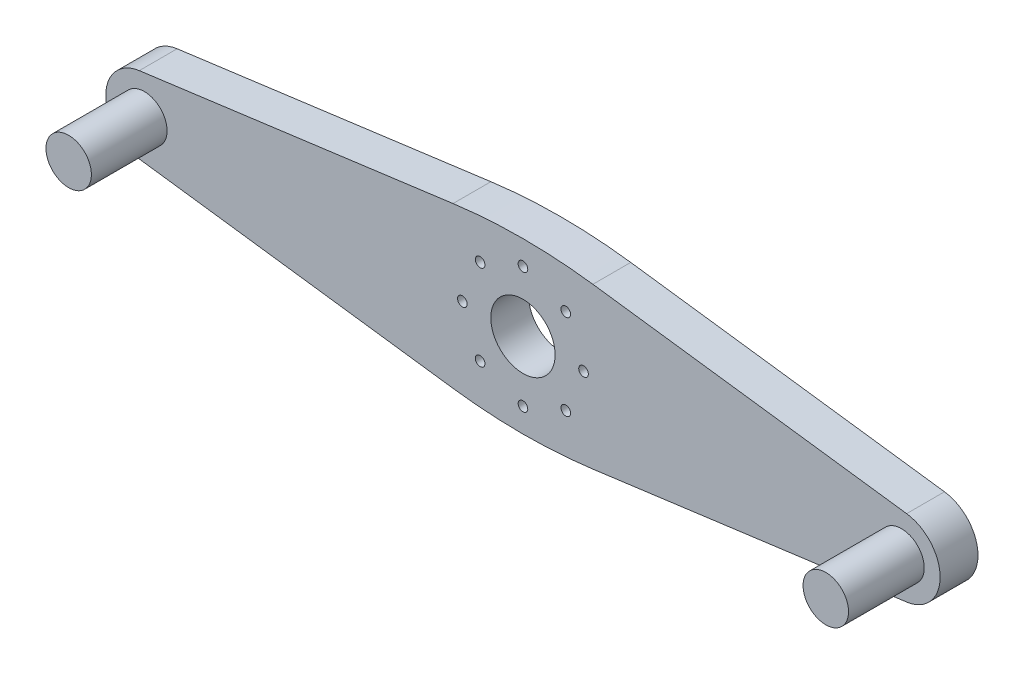
ISO-10303-21;
HEADER;
FILE_DESCRIPTION(('STEP AP214'),'2;1');
FILE_NAME('part.step','',(''),(''),'','','');
FILE_SCHEMA(('AUTOMOTIVE_DESIGN { 1 0 10303 214 1 1 1 1 }'));
ENDSEC;
DATA;
#1=APPLICATION_CONTEXT('core data for automotive mechanical design processes');
#2=APPLICATION_PROTOCOL_DEFINITION('international standard','automotive_design',2000,#1);
#3=PRODUCT_CONTEXT('',#1,'mechanical');
#4=PRODUCT('Part','Part','',(#3));
#5=PRODUCT_RELATED_PRODUCT_CATEGORY('part','',(#4));
#6=PRODUCT_DEFINITION_FORMATION('','',#4);
#7=PRODUCT_DEFINITION_CONTEXT('part definition',#1,'design');
#8=PRODUCT_DEFINITION('design','',#6,#7);
#9=PRODUCT_DEFINITION_SHAPE('','',#8);
#10=(LENGTH_UNIT() NAMED_UNIT(*) SI_UNIT(.MILLI.,.METRE.));
#11=(NAMED_UNIT(*) PLANE_ANGLE_UNIT() SI_UNIT($,.RADIAN.));
#12=(NAMED_UNIT(*) SI_UNIT($,.STERADIAN.) SOLID_ANGLE_UNIT());
#13=UNCERTAINTY_MEASURE_WITH_UNIT(LENGTH_MEASURE(1.E-05),#10,'distance_accuracy_value','');
#14=(GEOMETRIC_REPRESENTATION_CONTEXT(3) GLOBAL_UNCERTAINTY_ASSIGNED_CONTEXT((#13)) GLOBAL_UNIT_ASSIGNED_CONTEXT((#10,
#11,#12)) REPRESENTATION_CONTEXT('',''));
#15=CARTESIAN_POINT('',(0.,0.,0.));
#16=DIRECTION('',(0.,0.,1.));
#17=DIRECTION('',(1.,0.,0.));
#18=AXIS2_PLACEMENT_3D('',#15,#16,#17);
#19=CARTESIAN_POINT('',(50.,0.,5.));
#20=DIRECTION('',(0.,0.,-1.));
#21=DIRECTION('',(-1.,0.,0.));
#22=AXIS2_PLACEMENT_3D('',#19,#20,#21);
#23=PLANE('',#22);
#24=CARTESIAN_POINT('',(50.,0.,5.));
#25=DIRECTION('',(0.,0.,1.));
#26=DIRECTION('',(-1.,0.,0.));
#27=AXIS2_PLACEMENT_3D('',#24,#25,#26);
#28=CIRCLE('',#27,5.10024633771241);
#29=CARTESIAN_POINT('',(50.6728763500851,-5.05566515137672,5.));
#30=VERTEX_POINT('',#29);
#31=CARTESIAN_POINT('',(50.6728763500851,5.05566515137672,5.));
#32=VERTEX_POINT('',#31);
#33=EDGE_CURVE('E147',#30,#32,#28,.T.);
#34=ORIENTED_EDGE('',*,*,#33,.T.);
#35=DIRECTION('',(-0.991259013117456,0.131930166805804,0.));
#36=VECTOR('',#35,1.);
#37=CARTESIAN_POINT('',(50.6728763500851,5.05566515137672,5.));
#38=LINE('',#37,#36);
#39=CARTESIAN_POINT('',(9.2351116764065,10.5707637614413,5.));
#40=VERTEX_POINT('',#39);
#41=EDGE_CURVE('E95',#32,#40,#38,.T.);
#42=ORIENTED_EDGE('',*,*,#41,.T.);
#43=CARTESIAN_POINT('',(0.,-58.8173671567806,5.));
#44=DIRECTION('',(0.,0.,1.));
#45=DIRECTION('',(-1.,0.,0.));
#46=AXIS2_PLACEMENT_3D('',#43,#44,#45);
#47=CIRCLE('',#46,70.);
#48=CARTESIAN_POINT('',(-9.23511167640649,10.5707637614413,5.));
#49=VERTEX_POINT('',#48);
#50=EDGE_CURVE('E162',#40,#49,#47,.T.);
#51=ORIENTED_EDGE('',*,*,#50,.T.);
#52=DIRECTION('',(-0.991259013117456,-0.131930166805804,0.));
#53=VECTOR('',#52,1.);
#54=CARTESIAN_POINT('',(-50.6728763500851,5.05566515137672,5.));
#55=LINE('',#54,#53);
#56=CARTESIAN_POINT('',(-50.6728763500851,5.05566515137672,5.));
#57=VERTEX_POINT('',#56);
#58=EDGE_CURVE('E175',#49,#57,#55,.T.);
#59=ORIENTED_EDGE('',*,*,#58,.T.);
#60=CARTESIAN_POINT('',(-50.,0.,5.));
#61=DIRECTION('',(0.,0.,1.));
#62=DIRECTION('',(1.,0.,0.));
#63=AXIS2_PLACEMENT_3D('',#60,#61,#62);
#64=CIRCLE('',#63,5.10024633771241);
#65=CARTESIAN_POINT('',(-50.6728763500851,-5.05566515137672,5.));
#66=VERTEX_POINT('',#65);
#67=EDGE_CURVE('E114',#57,#66,#64,.T.);
#68=ORIENTED_EDGE('',*,*,#67,.T.);
#69=DIRECTION('',(0.991259013117456,-0.131930166805804,0.));
#70=VECTOR('',#69,1.);
#71=CARTESIAN_POINT('',(-50.6728763500851,-5.05566515137672,5.));
#72=LINE('',#71,#70);
#73=CARTESIAN_POINT('',(-9.23511167640653,-10.5707637614413,5.));
#74=VERTEX_POINT('',#73);
#75=EDGE_CURVE('E108',#66,#74,#72,.T.);
#76=ORIENTED_EDGE('',*,*,#75,.T.);
#77=CARTESIAN_POINT('',(0.,58.8173671567806,5.));
#78=DIRECTION('',(0.,0.,1.));
#79=DIRECTION('',(1.,0.,0.));
#80=AXIS2_PLACEMENT_3D('',#77,#78,#79);
#81=CIRCLE('',#80,70.);
#82=CARTESIAN_POINT('',(9.23511167640649,-10.5707637614413,5.));
#83=VERTEX_POINT('',#82);
#84=EDGE_CURVE('E112',#74,#83,#81,.T.);
#85=ORIENTED_EDGE('',*,*,#84,.T.);
#86=DIRECTION('',(0.991259013117456,0.131930166805804,0.));
#87=VECTOR('',#86,1.);
#88=CARTESIAN_POINT('',(50.6728763500851,-5.05566515137672,5.));
#89=LINE('',#88,#87);
#90=EDGE_CURVE('E52',#83,#30,#89,.T.);
#91=ORIENTED_EDGE('',*,*,#90,.T.);
#92=EDGE_LOOP('',(#34,#42,#51,#59,#68,#76,#85,#91));
#93=FACE_BOUND('',#92,.T.);
#94=CARTESIAN_POINT('',(0.,0.,5.));
#95=DIRECTION('',(0.,0.,1.));
#96=DIRECTION('',(1.,0.,0.));
#97=AXIS2_PLACEMENT_3D('',#94,#95,#96);
#98=CIRCLE('',#97,4.25);
#99=CARTESIAN_POINT('',(4.25,0.,5.));
#100=VERTEX_POINT('',#99);
#101=EDGE_CURVE('E136',#100,#100,#98,.T.);
#102=ORIENTED_EDGE('',*,*,#101,.F.);
#103=EDGE_LOOP('',(#102));
#104=FACE_BOUND('',#103,.T.);
#105=CARTESIAN_POINT('',(-8.,0.,5.));
#106=DIRECTION('',(0.,0.,1.));
#107=DIRECTION('',(1.,0.,0.));
#108=AXIS2_PLACEMENT_3D('',#105,#106,#107);
#109=CIRCLE('',#108,0.635000000000001);
#110=CARTESIAN_POINT('',(-7.365,0.,5.));
#111=VERTEX_POINT('',#110);
#112=EDGE_CURVE('E184',#111,#111,#109,.T.);
#113=ORIENTED_EDGE('',*,*,#112,.F.);
#114=EDGE_LOOP('',(#113));
#115=FACE_BOUND('',#114,.T.);
#116=CARTESIAN_POINT('',(-50.,0.,5.));
#117=DIRECTION('',(0.,0.,1.));
#118=DIRECTION('',(1.,0.,0.));
#119=AXIS2_PLACEMENT_3D('',#116,#117,#118);
#120=CIRCLE('',#119,3.);
#121=CARTESIAN_POINT('',(-47.,0.,5.));
#122=VERTEX_POINT('',#121);
#123=EDGE_CURVE('E190',#122,#122,#120,.T.);
#124=ORIENTED_EDGE('',*,*,#123,.F.);
#125=EDGE_LOOP('',(#124));
#126=FACE_BOUND('',#125,.T.);
#127=CARTESIAN_POINT('',(-5.65685424949237,5.65685424949239,5.));
#128=DIRECTION('',(0.,0.,1.));
#129=DIRECTION('',(1.,0.,0.));
#130=AXIS2_PLACEMENT_3D('',#127,#128,#129);
#131=CIRCLE('',#130,0.635000000000001);
#132=CARTESIAN_POINT('',(-5.02185424949237,5.65685424949239,5.));
#133=VERTEX_POINT('',#132);
#134=EDGE_CURVE('E195',#133,#133,#131,.T.);
#135=ORIENTED_EDGE('',*,*,#134,.F.);
#136=EDGE_LOOP('',(#135));
#137=FACE_BOUND('',#136,.T.);
#138=CARTESIAN_POINT('',(0.,8.,5.));
#139=DIRECTION('',(0.,0.,1.));
#140=DIRECTION('',(1.,0.,0.));
#141=AXIS2_PLACEMENT_3D('',#138,#139,#140);
#142=CIRCLE('',#141,0.635000000000001);
#143=CARTESIAN_POINT('',(0.63500000000003,8.,5.));
#144=VERTEX_POINT('',#143);
#145=EDGE_CURVE('E199',#144,#144,#142,.T.);
#146=ORIENTED_EDGE('',*,*,#145,.F.);
#147=EDGE_LOOP('',(#146));
#148=FACE_BOUND('',#147,.T.);
#149=CARTESIAN_POINT('',(50.,0.,5.));
#150=DIRECTION('',(0.,0.,1.));
#151=DIRECTION('',(-1.,0.,0.));
#152=AXIS2_PLACEMENT_3D('',#149,#150,#151);
#153=CIRCLE('',#152,3.);
#154=CARTESIAN_POINT('',(47.,0.,5.));
#155=VERTEX_POINT('',#154);
#156=EDGE_CURVE('E205',#155,#155,#153,.T.);
#157=ORIENTED_EDGE('',*,*,#156,.F.);
#158=EDGE_LOOP('',(#157));
#159=FACE_BOUND('',#158,.T.);
#160=CARTESIAN_POINT('',(5.65685424949241,5.65685424949235,5.));
#161=DIRECTION('',(0.,0.,1.));
#162=DIRECTION('',(1.,0.,0.));
#163=AXIS2_PLACEMENT_3D('',#160,#161,#162);
#164=CIRCLE('',#163,0.635);
#165=CARTESIAN_POINT('',(6.29185424949241,5.65685424949235,5.));
#166=VERTEX_POINT('',#165);
#167=EDGE_CURVE('E210',#166,#166,#164,.T.);
#168=ORIENTED_EDGE('',*,*,#167,.F.);
#169=EDGE_LOOP('',(#168));
#170=FACE_BOUND('',#169,.T.);
#171=CARTESIAN_POINT('',(8.,0.,5.));
#172=DIRECTION('',(0.,0.,1.));
#173=DIRECTION('',(1.,0.,0.));
#174=AXIS2_PLACEMENT_3D('',#171,#172,#173);
#175=CIRCLE('',#174,0.635);
#176=CARTESIAN_POINT('',(8.635,0.,5.));
#177=VERTEX_POINT('',#176);
#178=EDGE_CURVE('E214',#177,#177,#175,.T.);
#179=ORIENTED_EDGE('',*,*,#178,.F.);
#180=EDGE_LOOP('',(#179));
#181=FACE_BOUND('',#180,.T.);
#182=CARTESIAN_POINT('',(5.65685424949233,-5.65685424949243,5.));
#183=DIRECTION('',(0.,0.,1.));
#184=DIRECTION('',(1.,0.,0.));
#185=AXIS2_PLACEMENT_3D('',#182,#183,#184);
#186=CIRCLE('',#185,0.635000000000001);
#187=CARTESIAN_POINT('',(6.29185424949233,-5.65685424949243,5.));
#188=VERTEX_POINT('',#187);
#189=EDGE_CURVE('E220',#188,#188,#186,.T.);
#190=ORIENTED_EDGE('',*,*,#189,.F.);
#191=EDGE_LOOP('',(#190));
#192=FACE_BOUND('',#191,.T.);
#193=CARTESIAN_POINT('',(0.,-8.,5.));
#194=DIRECTION('',(0.,0.,1.));
#195=DIRECTION('',(1.,0.,0.));
#196=AXIS2_PLACEMENT_3D('',#193,#194,#195);
#197=CIRCLE('',#196,0.635);
#198=CARTESIAN_POINT('',(0.634999999999915,-8.,5.));
#199=VERTEX_POINT('',#198);
#200=EDGE_CURVE('E226',#199,#199,#197,.T.);
#201=ORIENTED_EDGE('',*,*,#200,.F.);
#202=EDGE_LOOP('',(#201));
#203=FACE_BOUND('',#202,.T.);
#204=CARTESIAN_POINT('',(-5.65685424949245,-5.65685424949231,5.));
#205=DIRECTION('',(0.,0.,1.));
#206=DIRECTION('',(1.,0.,0.));
#207=AXIS2_PLACEMENT_3D('',#204,#205,#206);
#208=CIRCLE('',#207,0.635);
#209=CARTESIAN_POINT('',(-5.02185424949245,-5.65685424949231,5.));
#210=VERTEX_POINT('',#209);
#211=EDGE_CURVE('E232',#210,#210,#208,.T.);
#212=ORIENTED_EDGE('',*,*,#211,.F.);
#213=EDGE_LOOP('',(#212));
#214=FACE_BOUND('',#213,.T.);
#215=ADVANCED_FACE('F35',(#93,#104,#115,#126,#137,#148,#159,#170,#181,#192,#203,#214),#23,.F.);
#216=CARTESIAN_POINT('',(50.,0.,0.));
#217=DIRECTION('',(0.,0.,-1.));
#218=DIRECTION('',(-1.,0.,0.));
#219=AXIS2_PLACEMENT_3D('',#216,#217,#218);
#220=PLANE('',#219);
#221=CARTESIAN_POINT('',(0.,-8.,0.));
#222=DIRECTION('',(0.,0.,1.));
#223=DIRECTION('',(1.,0.,0.));
#224=AXIS2_PLACEMENT_3D('',#221,#222,#223);
#225=CIRCLE('',#224,0.635);
#226=CARTESIAN_POINT('',(0.634999999999915,-8.,0.));
#227=VERTEX_POINT('',#226);
#228=EDGE_CURVE('E229',#227,#227,#225,.T.);
#229=ORIENTED_EDGE('',*,*,#228,.T.);
#230=EDGE_LOOP('',(#229));
#231=FACE_BOUND('',#230,.T.);
#232=CARTESIAN_POINT('',(8.,0.,0.));
#233=DIRECTION('',(0.,0.,1.));
#234=DIRECTION('',(1.,0.,0.));
#235=AXIS2_PLACEMENT_3D('',#232,#233,#234);
#236=CIRCLE('',#235,0.635);
#237=CARTESIAN_POINT('',(8.635,0.,0.));
#238=VERTEX_POINT('',#237);
#239=EDGE_CURVE('E217',#238,#238,#236,.T.);
#240=ORIENTED_EDGE('',*,*,#239,.T.);
#241=EDGE_LOOP('',(#240));
#242=FACE_BOUND('',#241,.T.);
#243=CARTESIAN_POINT('',(-5.65685424949237,5.65685424949239,0.));
#244=DIRECTION('',(0.,0.,1.));
#245=DIRECTION('',(1.,0.,0.));
#246=AXIS2_PLACEMENT_3D('',#243,#244,#245);
#247=CIRCLE('',#246,0.635000000000001);
#248=CARTESIAN_POINT('',(-5.02185424949237,5.65685424949239,0.));
#249=VERTEX_POINT('',#248);
#250=EDGE_CURVE('E196',#249,#249,#247,.T.);
#251=ORIENTED_EDGE('',*,*,#250,.T.);
#252=EDGE_LOOP('',(#251));
#253=FACE_BOUND('',#252,.T.);
#254=CARTESIAN_POINT('',(-8.,0.,0.));
#255=DIRECTION('',(0.,0.,1.));
#256=DIRECTION('',(1.,0.,0.));
#257=AXIS2_PLACEMENT_3D('',#254,#255,#256);
#258=CIRCLE('',#257,0.635000000000001);
#259=CARTESIAN_POINT('',(-7.365,0.,0.));
#260=VERTEX_POINT('',#259);
#261=EDGE_CURVE('E187',#260,#260,#258,.T.);
#262=ORIENTED_EDGE('',*,*,#261,.T.);
#263=EDGE_LOOP('',(#262));
#264=FACE_BOUND('',#263,.T.);
#265=CARTESIAN_POINT('',(50.,0.,0.));
#266=DIRECTION('',(0.,0.,1.));
#267=DIRECTION('',(-1.,0.,0.));
#268=AXIS2_PLACEMENT_3D('',#265,#266,#267);
#269=CIRCLE('',#268,5.10024633771241);
#270=CARTESIAN_POINT('',(50.6728763500851,-5.05566515137672,0.));
#271=VERTEX_POINT('',#270);
#272=CARTESIAN_POINT('',(50.6728763500851,5.05566515137672,0.));
#273=VERTEX_POINT('',#272);
#274=EDGE_CURVE('E132',#271,#273,#269,.T.);
#275=ORIENTED_EDGE('',*,*,#274,.F.);
#276=DIRECTION('',(0.991259013117456,0.131930166805804,0.));
#277=VECTOR('',#276,1.);
#278=CARTESIAN_POINT('',(50.6728763500851,-5.05566515137672,0.));
#279=LINE('',#278,#277);
#280=CARTESIAN_POINT('',(9.23511167640649,-10.5707637614413,0.));
#281=VERTEX_POINT('',#280);
#282=EDGE_CURVE('E87',#281,#271,#279,.T.);
#283=ORIENTED_EDGE('',*,*,#282,.F.);
#284=CARTESIAN_POINT('',(0.,58.8173671567806,0.));
#285=DIRECTION('',(0.,0.,1.));
#286=DIRECTION('',(1.,0.,0.));
#287=AXIS2_PLACEMENT_3D('',#284,#285,#286);
#288=CIRCLE('',#287,70.);
#289=CARTESIAN_POINT('',(-9.23511167640653,-10.5707637614413,0.));
#290=VERTEX_POINT('',#289);
#291=EDGE_CURVE('E81',#290,#281,#288,.T.);
#292=ORIENTED_EDGE('',*,*,#291,.F.);
#293=DIRECTION('',(0.991259013117456,-0.131930166805804,0.));
#294=VECTOR('',#293,1.);
#295=CARTESIAN_POINT('',(-50.6728763500851,-5.05566515137672,0.));
#296=LINE('',#295,#294);
#297=CARTESIAN_POINT('',(-50.6728763500851,-5.05566515137672,0.));
#298=VERTEX_POINT('',#297);
#299=EDGE_CURVE('E122',#298,#290,#296,.T.);
#300=ORIENTED_EDGE('',*,*,#299,.F.);
#301=CARTESIAN_POINT('',(-50.,0.,0.));
#302=DIRECTION('',(0.,0.,1.));
#303=DIRECTION('',(1.,0.,0.));
#304=AXIS2_PLACEMENT_3D('',#301,#302,#303);
#305=CIRCLE('',#304,5.10024633771241);
#306=CARTESIAN_POINT('',(-50.6728763500851,5.05566515137672,0.));
#307=VERTEX_POINT('',#306);
#308=EDGE_CURVE('E142',#307,#298,#305,.T.);
#309=ORIENTED_EDGE('',*,*,#308,.F.);
#310=DIRECTION('',(-0.991259013117456,-0.131930166805804,0.));
#311=VECTOR('',#310,1.);
#312=CARTESIAN_POINT('',(-50.6728763500851,5.05566515137672,0.));
#313=LINE('',#312,#311);
#314=CARTESIAN_POINT('',(-9.23511167640649,10.5707637614413,0.));
#315=VERTEX_POINT('',#314);
#316=EDGE_CURVE('E140',#315,#307,#313,.T.);
#317=ORIENTED_EDGE('',*,*,#316,.F.);
#318=CARTESIAN_POINT('',(0.,-58.8173671567806,0.));
#319=DIRECTION('',(0.,0.,1.));
#320=DIRECTION('',(-1.,0.,0.));
#321=AXIS2_PLACEMENT_3D('',#318,#319,#320);
#322=CIRCLE('',#321,70.);
#323=CARTESIAN_POINT('',(9.2351116764065,10.5707637614413,0.));
#324=VERTEX_POINT('',#323);
#325=EDGE_CURVE('E138',#324,#315,#322,.T.);
#326=ORIENTED_EDGE('',*,*,#325,.F.);
#327=DIRECTION('',(-0.991259013117456,0.131930166805804,0.));
#328=VECTOR('',#327,1.);
#329=CARTESIAN_POINT('',(50.6728763500851,5.05566515137672,0.));
#330=LINE('',#329,#328);
#331=EDGE_CURVE('E135',#273,#324,#330,.T.);
#332=ORIENTED_EDGE('',*,*,#331,.F.);
#333=EDGE_LOOP('',(#275,#283,#292,#300,#309,#317,#326,#332));
#334=FACE_BOUND('',#333,.T.);
#335=CARTESIAN_POINT('',(0.,0.,0.));
#336=DIRECTION('',(0.,0.,1.));
#337=DIRECTION('',(1.,0.,0.));
#338=AXIS2_PLACEMENT_3D('',#335,#336,#337);
#339=CIRCLE('',#338,4.25);
#340=CARTESIAN_POINT('',(4.25,0.,0.));
#341=VERTEX_POINT('',#340);
#342=EDGE_CURVE('E181',#341,#341,#339,.T.);
#343=ORIENTED_EDGE('',*,*,#342,.T.);
#344=EDGE_LOOP('',(#343));
#345=FACE_BOUND('',#344,.T.);
#346=CARTESIAN_POINT('',(0.,8.,0.));
#347=DIRECTION('',(0.,0.,1.));
#348=DIRECTION('',(1.,0.,0.));
#349=AXIS2_PLACEMENT_3D('',#346,#347,#348);
#350=CIRCLE('',#349,0.635000000000001);
#351=CARTESIAN_POINT('',(0.63500000000003,8.,0.));
#352=VERTEX_POINT('',#351);
#353=EDGE_CURVE('E202',#352,#352,#350,.T.);
#354=ORIENTED_EDGE('',*,*,#353,.T.);
#355=EDGE_LOOP('',(#354));
#356=FACE_BOUND('',#355,.T.);
#357=CARTESIAN_POINT('',(5.65685424949241,5.65685424949235,0.));
#358=DIRECTION('',(0.,0.,1.));
#359=DIRECTION('',(1.,0.,0.));
#360=AXIS2_PLACEMENT_3D('',#357,#358,#359);
#361=CIRCLE('',#360,0.635);
#362=CARTESIAN_POINT('',(6.29185424949241,5.65685424949235,0.));
#363=VERTEX_POINT('',#362);
#364=EDGE_CURVE('E211',#363,#363,#361,.T.);
#365=ORIENTED_EDGE('',*,*,#364,.T.);
#366=EDGE_LOOP('',(#365));
#367=FACE_BOUND('',#366,.T.);
#368=CARTESIAN_POINT('',(5.65685424949233,-5.65685424949243,0.));
#369=DIRECTION('',(0.,0.,1.));
#370=DIRECTION('',(1.,0.,0.));
#371=AXIS2_PLACEMENT_3D('',#368,#369,#370);
#372=CIRCLE('',#371,0.635000000000001);
#373=CARTESIAN_POINT('',(6.29185424949233,-5.65685424949243,0.));
#374=VERTEX_POINT('',#373);
#375=EDGE_CURVE('E223',#374,#374,#372,.T.);
#376=ORIENTED_EDGE('',*,*,#375,.T.);
#377=EDGE_LOOP('',(#376));
#378=FACE_BOUND('',#377,.T.);
#379=CARTESIAN_POINT('',(-5.65685424949245,-5.65685424949231,0.));
#380=DIRECTION('',(0.,0.,1.));
#381=DIRECTION('',(1.,0.,0.));
#382=AXIS2_PLACEMENT_3D('',#379,#380,#381);
#383=CIRCLE('',#382,0.635);
#384=CARTESIAN_POINT('',(-5.02185424949245,-5.65685424949231,0.));
#385=VERTEX_POINT('',#384);
#386=EDGE_CURVE('E235',#385,#385,#383,.T.);
#387=ORIENTED_EDGE('',*,*,#386,.T.);
#388=EDGE_LOOP('',(#387));
#389=FACE_BOUND('',#388,.T.);
#390=ADVANCED_FACE('F166',(#231,#242,#253,#264,#334,#345,#356,#367,#378,#389),#220,.T.);
#391=CARTESIAN_POINT('',(50.,0.,5.));
#392=DIRECTION('',(0.,0.,-1.));
#393=DIRECTION('',(-1.,0.,0.));
#394=AXIS2_PLACEMENT_3D('',#391,#392,#393);
#395=CYLINDRICAL_SURFACE('',#394,5.10024633771241);
#396=ORIENTED_EDGE('',*,*,#274,.T.);
#397=DIRECTION('',(0.,0.,-1.));
#398=VECTOR('',#397,1.);
#399=CARTESIAN_POINT('',(50.6728763500851,5.05566515137672,5.));
#400=LINE('',#399,#398);
#401=EDGE_CURVE('E11',#32,#273,#400,.T.);
#402=ORIENTED_EDGE('',*,*,#401,.F.);
#403=ORIENTED_EDGE('',*,*,#33,.F.);
#404=DIRECTION('',(0.,0.,-1.));
#405=VECTOR('',#404,1.);
#406=CARTESIAN_POINT('',(50.6728763500851,-5.05566515137672,5.));
#407=LINE('',#406,#405);
#408=EDGE_CURVE('E128',#30,#271,#407,.T.);
#409=ORIENTED_EDGE('',*,*,#408,.T.);
#410=EDGE_LOOP('',(#396,#402,#403,#409));
#411=FACE_BOUND('',#410,.T.);
#412=ADVANCED_FACE('F37',(#411),#395,.T.);
#413=CARTESIAN_POINT('',(50.6728763500851,5.05566515137672,5.));
#414=DIRECTION('',(-0.131930166805804,-0.991259013117456,0.));
#415=DIRECTION('',(0.991259013117456,-0.131930166805804,0.));
#416=AXIS2_PLACEMENT_3D('',#413,#414,#415);
#417=PLANE('',#416);
#418=ORIENTED_EDGE('',*,*,#331,.T.);
#419=DIRECTION('',(0.,0.,-1.));
#420=VECTOR('',#419,1.);
#421=CARTESIAN_POINT('',(9.2351116764065,10.5707637614413,5.));
#422=LINE('',#421,#420);
#423=EDGE_CURVE('E44',#40,#324,#422,.T.);
#424=ORIENTED_EDGE('',*,*,#423,.F.);
#425=ORIENTED_EDGE('',*,*,#41,.F.);
#426=ORIENTED_EDGE('',*,*,#401,.T.);
#427=EDGE_LOOP('',(#418,#424,#425,#426));
#428=FACE_BOUND('',#427,.T.);
#429=ADVANCED_FACE('F281',(#428),#417,.F.);
#430=CARTESIAN_POINT('',(0.,-58.8173671567806,5.));
#431=DIRECTION('',(0.,0.,-1.));
#432=DIRECTION('',(-1.,0.,0.));
#433=AXIS2_PLACEMENT_3D('',#430,#431,#432);
#434=CYLINDRICAL_SURFACE('',#433,70.);
#435=ORIENTED_EDGE('',*,*,#325,.T.);
#436=DIRECTION('',(0.,0.,-1.));
#437=VECTOR('',#436,1.);
#438=CARTESIAN_POINT('',(-9.23511167640649,10.5707637614413,5.));
#439=LINE('',#438,#437);
#440=EDGE_CURVE('E154',#49,#315,#439,.T.);
#441=ORIENTED_EDGE('',*,*,#440,.F.);
#442=ORIENTED_EDGE('',*,*,#50,.F.);
#443=ORIENTED_EDGE('',*,*,#423,.T.);
#444=EDGE_LOOP('',(#435,#441,#442,#443));
#445=FACE_BOUND('',#444,.T.);
#446=ADVANCED_FACE('F160',(#445),#434,.T.);
#447=CARTESIAN_POINT('',(-50.6728763500851,5.05566515137672,5.));
#448=DIRECTION('',(0.131930166805804,-0.991259013117456,0.));
#449=DIRECTION('',(0.991259013117456,0.131930166805804,0.));
#450=AXIS2_PLACEMENT_3D('',#447,#448,#449);
#451=PLANE('',#450);
#452=ORIENTED_EDGE('',*,*,#316,.T.);
#453=DIRECTION('',(0.,0.,-1.));
#454=VECTOR('',#453,1.);
#455=CARTESIAN_POINT('',(-50.6728763500851,5.05566515137672,5.));
#456=LINE('',#455,#454);
#457=EDGE_CURVE('E151',#57,#307,#456,.T.);
#458=ORIENTED_EDGE('',*,*,#457,.F.);
#459=ORIENTED_EDGE('',*,*,#58,.F.);
#460=ORIENTED_EDGE('',*,*,#440,.T.);
#461=EDGE_LOOP('',(#452,#458,#459,#460));
#462=FACE_BOUND('',#461,.T.);
#463=ADVANCED_FACE('F171',(#462),#451,.F.);
#464=CARTESIAN_POINT('',(-50.,0.,5.));
#465=DIRECTION('',(0.,0.,-1.));
#466=DIRECTION('',(-1.,0.,0.));
#467=AXIS2_PLACEMENT_3D('',#464,#465,#466);
#468=CYLINDRICAL_SURFACE('',#467,5.10024633771241);
#469=ORIENTED_EDGE('',*,*,#308,.T.);
#470=DIRECTION('',(0.,0.,-1.));
#471=VECTOR('',#470,1.);
#472=CARTESIAN_POINT('',(-50.6728763500851,-5.05566515137672,5.));
#473=LINE('',#472,#471);
#474=EDGE_CURVE('E123',#66,#298,#473,.T.);
#475=ORIENTED_EDGE('',*,*,#474,.F.);
#476=ORIENTED_EDGE('',*,*,#67,.F.);
#477=ORIENTED_EDGE('',*,*,#457,.T.);
#478=EDGE_LOOP('',(#469,#475,#476,#477));
#479=FACE_BOUND('',#478,.T.);
#480=ADVANCED_FACE('F174',(#479),#468,.T.);
#481=CARTESIAN_POINT('',(-50.6728763500851,-5.05566515137672,5.));
#482=DIRECTION('',(0.131930166805804,0.991259013117456,0.));
#483=DIRECTION('',(-0.991259013117456,0.131930166805804,0.));
#484=AXIS2_PLACEMENT_3D('',#481,#482,#483);
#485=PLANE('',#484);
#486=ORIENTED_EDGE('',*,*,#299,.T.);
#487=DIRECTION('',(0.,0.,-1.));
#488=VECTOR('',#487,1.);
#489=CARTESIAN_POINT('',(-9.23511167640653,-10.5707637614413,5.));
#490=LINE('',#489,#488);
#491=EDGE_CURVE('E119',#74,#290,#490,.T.);
#492=ORIENTED_EDGE('',*,*,#491,.F.);
#493=ORIENTED_EDGE('',*,*,#75,.F.);
#494=ORIENTED_EDGE('',*,*,#474,.T.);
#495=EDGE_LOOP('',(#486,#492,#493,#494));
#496=FACE_BOUND('',#495,.T.);
#497=ADVANCED_FACE('F120',(#496),#485,.F.);
#498=CARTESIAN_POINT('',(0.,58.8173671567806,5.));
#499=DIRECTION('',(0.,0.,-1.));
#500=DIRECTION('',(-1.,0.,0.));
#501=AXIS2_PLACEMENT_3D('',#498,#499,#500);
#502=CYLINDRICAL_SURFACE('',#501,70.);
#503=ORIENTED_EDGE('',*,*,#291,.T.);
#504=DIRECTION('',(0.,0.,-1.));
#505=VECTOR('',#504,1.);
#506=CARTESIAN_POINT('',(9.23511167640649,-10.5707637614413,5.));
#507=LINE('',#506,#505);
#508=EDGE_CURVE('E124',#83,#281,#507,.T.);
#509=ORIENTED_EDGE('',*,*,#508,.F.);
#510=ORIENTED_EDGE('',*,*,#84,.F.);
#511=ORIENTED_EDGE('',*,*,#491,.T.);
#512=EDGE_LOOP('',(#503,#509,#510,#511));
#513=FACE_BOUND('',#512,.T.);
#514=ADVANCED_FACE('F126',(#513),#502,.T.);
#515=CARTESIAN_POINT('',(50.6728763500851,-5.05566515137672,5.));
#516=DIRECTION('',(-0.131930166805804,0.991259013117456,0.));
#517=DIRECTION('',(-0.991259013117456,-0.131930166805804,0.));
#518=AXIS2_PLACEMENT_3D('',#515,#516,#517);
#519=PLANE('',#518);
#520=ORIENTED_EDGE('',*,*,#282,.T.);
#521=ORIENTED_EDGE('',*,*,#408,.F.);
#522=ORIENTED_EDGE('',*,*,#90,.F.);
#523=ORIENTED_EDGE('',*,*,#508,.T.);
#524=EDGE_LOOP('',(#520,#521,#522,#523));
#525=FACE_BOUND('',#524,.T.);
#526=ADVANCED_FACE('F269',(#525),#519,.F.);
#527=CARTESIAN_POINT('',(0.,0.,5.));
#528=DIRECTION('',(0.,0.,-1.));
#529=DIRECTION('',(-1.,0.,0.));
#530=AXIS2_PLACEMENT_3D('',#527,#528,#529);
#531=CYLINDRICAL_SURFACE('',#530,4.25);
#532=ORIENTED_EDGE('',*,*,#101,.T.);
#533=EDGE_LOOP('',(#532));
#534=FACE_BOUND('',#533,.T.);
#535=ORIENTED_EDGE('',*,*,#342,.F.);
#536=EDGE_LOOP('',(#535));
#537=FACE_BOUND('',#536,.T.);
#538=ADVANCED_FACE('F266',(#534,#537),#531,.F.);
#539=CARTESIAN_POINT('',(-8.,0.,5.));
#540=DIRECTION('',(0.,0.,-1.));
#541=DIRECTION('',(-1.,0.,0.));
#542=AXIS2_PLACEMENT_3D('',#539,#540,#541);
#543=CYLINDRICAL_SURFACE('',#542,0.635000000000001);
#544=ORIENTED_EDGE('',*,*,#112,.T.);
#545=EDGE_LOOP('',(#544));
#546=FACE_BOUND('',#545,.T.);
#547=ORIENTED_EDGE('',*,*,#261,.F.);
#548=EDGE_LOOP('',(#547));
#549=FACE_BOUND('',#548,.T.);
#550=ADVANCED_FACE('F360',(#546,#549),#543,.F.);
#551=CARTESIAN_POINT('',(-5.65685424949237,5.65685424949239,5.));
#552=DIRECTION('',(0.,0.,-1.));
#553=DIRECTION('',(-1.,0.,0.));
#554=AXIS2_PLACEMENT_3D('',#551,#552,#553);
#555=CYLINDRICAL_SURFACE('',#554,0.635000000000001);
#556=ORIENTED_EDGE('',*,*,#134,.T.);
#557=EDGE_LOOP('',(#556));
#558=FACE_BOUND('',#557,.T.);
#559=ORIENTED_EDGE('',*,*,#250,.F.);
#560=EDGE_LOOP('',(#559));
#561=FACE_BOUND('',#560,.T.);
#562=ADVANCED_FACE('F357',(#558,#561),#555,.F.);
#563=CARTESIAN_POINT('',(0.,8.,5.));
#564=DIRECTION('',(0.,0.,-1.));
#565=DIRECTION('',(-1.,0.,0.));
#566=AXIS2_PLACEMENT_3D('',#563,#564,#565);
#567=CYLINDRICAL_SURFACE('',#566,0.635000000000001);
#568=ORIENTED_EDGE('',*,*,#145,.T.);
#569=EDGE_LOOP('',(#568));
#570=FACE_BOUND('',#569,.T.);
#571=ORIENTED_EDGE('',*,*,#353,.F.);
#572=EDGE_LOOP('',(#571));
#573=FACE_BOUND('',#572,.T.);
#574=ADVANCED_FACE('F353',(#570,#573),#567,.F.);
#575=CARTESIAN_POINT('',(5.65685424949241,5.65685424949235,5.));
#576=DIRECTION('',(0.,0.,-1.));
#577=DIRECTION('',(-1.,0.,0.));
#578=AXIS2_PLACEMENT_3D('',#575,#576,#577);
#579=CYLINDRICAL_SURFACE('',#578,0.635);
#580=ORIENTED_EDGE('',*,*,#167,.T.);
#581=EDGE_LOOP('',(#580));
#582=FACE_BOUND('',#581,.T.);
#583=ORIENTED_EDGE('',*,*,#364,.F.);
#584=EDGE_LOOP('',(#583));
#585=FACE_BOUND('',#584,.T.);
#586=ADVANCED_FACE('F349',(#582,#585),#579,.F.);
#587=CARTESIAN_POINT('',(8.,0.,5.));
#588=DIRECTION('',(0.,0.,-1.));
#589=DIRECTION('',(-1.,0.,0.));
#590=AXIS2_PLACEMENT_3D('',#587,#588,#589);
#591=CYLINDRICAL_SURFACE('',#590,0.635);
#592=ORIENTED_EDGE('',*,*,#178,.T.);
#593=EDGE_LOOP('',(#592));
#594=FACE_BOUND('',#593,.T.);
#595=ORIENTED_EDGE('',*,*,#239,.F.);
#596=EDGE_LOOP('',(#595));
#597=FACE_BOUND('',#596,.T.);
#598=ADVANCED_FACE('F345',(#594,#597),#591,.F.);
#599=CARTESIAN_POINT('',(5.65685424949233,-5.65685424949243,5.));
#600=DIRECTION('',(0.,0.,-1.));
#601=DIRECTION('',(-1.,0.,0.));
#602=AXIS2_PLACEMENT_3D('',#599,#600,#601);
#603=CYLINDRICAL_SURFACE('',#602,0.635000000000001);
#604=ORIENTED_EDGE('',*,*,#189,.T.);
#605=EDGE_LOOP('',(#604));
#606=FACE_BOUND('',#605,.T.);
#607=ORIENTED_EDGE('',*,*,#375,.F.);
#608=EDGE_LOOP('',(#607));
#609=FACE_BOUND('',#608,.T.);
#610=ADVANCED_FACE('F341',(#606,#609),#603,.F.);
#611=CARTESIAN_POINT('',(0.,-8.,5.));
#612=DIRECTION('',(0.,0.,-1.));
#613=DIRECTION('',(-1.,0.,0.));
#614=AXIS2_PLACEMENT_3D('',#611,#612,#613);
#615=CYLINDRICAL_SURFACE('',#614,0.635);
#616=ORIENTED_EDGE('',*,*,#200,.T.);
#617=EDGE_LOOP('',(#616));
#618=FACE_BOUND('',#617,.T.);
#619=ORIENTED_EDGE('',*,*,#228,.F.);
#620=EDGE_LOOP('',(#619));
#621=FACE_BOUND('',#620,.T.);
#622=ADVANCED_FACE('F337',(#618,#621),#615,.F.);
#623=CARTESIAN_POINT('',(-5.65685424949245,-5.65685424949231,5.));
#624=DIRECTION('',(0.,0.,-1.));
#625=DIRECTION('',(-1.,0.,0.));
#626=AXIS2_PLACEMENT_3D('',#623,#624,#625);
#627=CYLINDRICAL_SURFACE('',#626,0.635);
#628=ORIENTED_EDGE('',*,*,#211,.T.);
#629=EDGE_LOOP('',(#628));
#630=FACE_BOUND('',#629,.T.);
#631=ORIENTED_EDGE('',*,*,#386,.F.);
#632=EDGE_LOOP('',(#631));
#633=FACE_BOUND('',#632,.T.);
#634=ADVANCED_FACE('F303',(#630,#633),#627,.F.);
#635=CARTESIAN_POINT('',(-50.,0.,15.));
#636=DIRECTION('',(0.,0.,-1.));
#637=DIRECTION('',(-1.,0.,0.));
#638=AXIS2_PLACEMENT_3D('',#635,#636,#637);
#639=CYLINDRICAL_SURFACE('',#638,3.);
#640=CARTESIAN_POINT('',(-50.,0.,15.));
#641=DIRECTION('',(0.,0.,1.));
#642=DIRECTION('',(1.,0.,0.));
#643=AXIS2_PLACEMENT_3D('',#640,#641,#642);
#644=CIRCLE('',#643,3.);
#645=CARTESIAN_POINT('',(-47.,0.,15.));
#646=VERTEX_POINT('',#645);
#647=EDGE_CURVE('E238',#646,#646,#644,.T.);
#648=ORIENTED_EDGE('',*,*,#647,.F.);
#649=EDGE_LOOP('',(#648));
#650=FACE_BOUND('',#649,.T.);
#651=ORIENTED_EDGE('',*,*,#123,.T.);
#652=EDGE_LOOP('',(#651));
#653=FACE_BOUND('',#652,.T.);
#654=ADVANCED_FACE('F308',(#650,#653),#639,.T.);
#655=CARTESIAN_POINT('',(0.,0.,15.));
#656=DIRECTION('',(0.,0.,1.));
#657=DIRECTION('',(1.,0.,0.));
#658=AXIS2_PLACEMENT_3D('',#655,#656,#657);
#659=PLANE('',#658);
#660=ORIENTED_EDGE('',*,*,#647,.T.);
#661=EDGE_LOOP('',(#660));
#662=FACE_BOUND('',#661,.T.);
#663=ADVANCED_FACE('F256',(#662),#659,.T.);
#664=CARTESIAN_POINT('',(50.,0.,15.));
#665=DIRECTION('',(0.,0.,-1.));
#666=DIRECTION('',(-1.,0.,0.));
#667=AXIS2_PLACEMENT_3D('',#664,#665,#666);
#668=CYLINDRICAL_SURFACE('',#667,3.);
#669=CARTESIAN_POINT('',(50.,0.,15.));
#670=DIRECTION('',(0.,0.,1.));
#671=DIRECTION('',(1.,0.,0.));
#672=AXIS2_PLACEMENT_3D('',#669,#670,#671);
#673=CIRCLE('',#672,3.);
#674=CARTESIAN_POINT('',(53.,0.,15.));
#675=VERTEX_POINT('',#674);
#676=EDGE_CURVE('E243',#675,#675,#673,.F.);
#677=ORIENTED_EDGE('',*,*,#676,.T.);
#678=EDGE_LOOP('',(#677));
#679=FACE_BOUND('',#678,.T.);
#680=ORIENTED_EDGE('',*,*,#156,.T.);
#681=EDGE_LOOP('',(#680));
#682=FACE_BOUND('',#681,.T.);
#683=ADVANCED_FACE('F247',(#679,#682),#668,.T.);
#684=CARTESIAN_POINT('',(0.,0.,15.));
#685=DIRECTION('',(0.,0.,1.));
#686=DIRECTION('',(1.,0.,0.));
#687=AXIS2_PLACEMENT_3D('',#684,#685,#686);
#688=PLANE('',#687);
#689=ORIENTED_EDGE('',*,*,#676,.F.);
#690=EDGE_LOOP('',(#689));
#691=FACE_BOUND('',#690,.T.);
#692=ADVANCED_FACE('F250',(#691),#688,.T.);
#693=CLOSED_SHELL('',(#215,#390,#412,#429,#446,#463,#480,#497,#514,#526,#538,#550,#562,#574,
#586,#598,#610,#622,#634,#654,#663,#683,#692));
#694=MANIFOLD_SOLID_BREP('B2',#693);
#695=ADVANCED_BREP_SHAPE_REPRESENTATION('',(#18,#694),#14);
#696=SHAPE_DEFINITION_REPRESENTATION(#9,#695);
ENDSEC;
END-ISO-10303-21;
